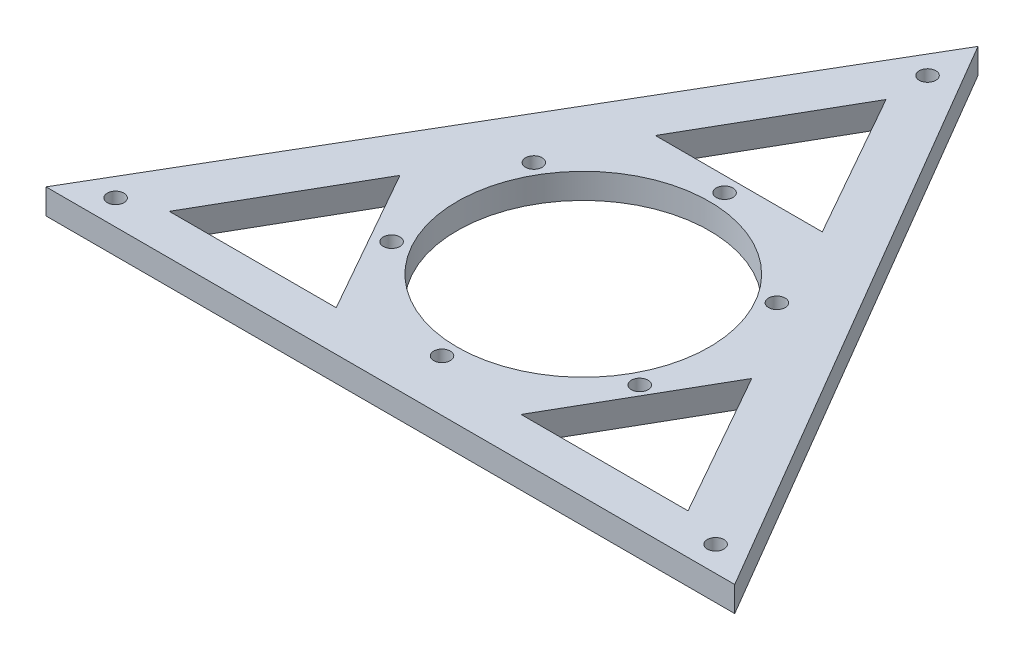
ISO-10303-21;
HEADER;
FILE_DESCRIPTION(('STEP AP214'),'2;1');
FILE_NAME('part.step','',(''),(''),'','','');
FILE_SCHEMA(('AUTOMOTIVE_DESIGN { 1 0 10303 214 1 1 1 1 }'));
ENDSEC;
DATA;
#1=APPLICATION_CONTEXT('core data for automotive mechanical design processes');
#2=APPLICATION_PROTOCOL_DEFINITION('international standard','automotive_design',2000,#1);
#3=PRODUCT_CONTEXT('',#1,'mechanical');
#4=PRODUCT('Part','Part','',(#3));
#5=PRODUCT_RELATED_PRODUCT_CATEGORY('part','',(#4));
#6=PRODUCT_DEFINITION_FORMATION('','',#4);
#7=PRODUCT_DEFINITION_CONTEXT('part definition',#1,'design');
#8=PRODUCT_DEFINITION('design','',#6,#7);
#9=PRODUCT_DEFINITION_SHAPE('','',#8);
#10=(LENGTH_UNIT() NAMED_UNIT(*) SI_UNIT(.MILLI.,.METRE.));
#11=(NAMED_UNIT(*) PLANE_ANGLE_UNIT() SI_UNIT($,.RADIAN.));
#12=(NAMED_UNIT(*) SI_UNIT($,.STERADIAN.) SOLID_ANGLE_UNIT());
#13=UNCERTAINTY_MEASURE_WITH_UNIT(LENGTH_MEASURE(1.E-05),#10,'distance_accuracy_value','');
#14=(GEOMETRIC_REPRESENTATION_CONTEXT(3) GLOBAL_UNCERTAINTY_ASSIGNED_CONTEXT((#13)) GLOBAL_UNIT_ASSIGNED_CONTEXT((#10,
#11,#12)) REPRESENTATION_CONTEXT('',''));
#15=CARTESIAN_POINT('',(0.,0.,0.));
#16=DIRECTION('',(0.,0.,1.));
#17=DIRECTION('',(1.,0.,0.));
#18=AXIS2_PLACEMENT_3D('',#15,#16,#17);
#19=CARTESIAN_POINT('',(34.1242695856853,5.,-19.9966620230598));
#20=DIRECTION('',(-0.862777602849667,0.,0.505583631084891));
#21=DIRECTION('',(0.505583631084891,0.,0.862777602849667));
#22=AXIS2_PLACEMENT_3D('',#19,#20,#21);
#23=PLANE('',#22);
#24=DIRECTION('',(-0.505583631084891,0.,-0.862777602849667));
#25=VECTOR('',#24,1.);
#26=CARTESIAN_POINT('',(34.1242695856853,0.,-19.9966620230598));
#27=LINE('',#26,#25);
#28=CARTESIAN_POINT('',(68.2485391713706,0.,38.2363457366197));
#29=VERTEX_POINT('',#28);
#30=CARTESIAN_POINT('',(0.,0.,-78.2296697827392));
#31=VERTEX_POINT('',#30);
#32=EDGE_CURVE('E151',#29,#31,#27,.T.);
#33=ORIENTED_EDGE('',*,*,#32,.T.);
#34=DIRECTION('',(0.,-1.,0.));
#35=VECTOR('',#34,1.);
#36=CARTESIAN_POINT('',(0.,5.,-78.2296697827392));
#37=LINE('',#36,#35);
#38=CARTESIAN_POINT('',(0.,5.,-78.2296697827392));
#39=VERTEX_POINT('',#38);
#40=EDGE_CURVE('E11',#39,#31,#37,.T.);
#41=ORIENTED_EDGE('',*,*,#40,.F.);
#42=DIRECTION('',(-0.505583631084891,0.,-0.862777602849667));
#43=VECTOR('',#42,1.);
#44=CARTESIAN_POINT('',(34.1242695856853,5.,-19.9966620230598));
#45=LINE('',#44,#43);
#46=CARTESIAN_POINT('',(68.2485391713706,5.,38.2363457366197));
#47=VERTEX_POINT('',#46);
#48=EDGE_CURVE('E142',#47,#39,#45,.T.);
#49=ORIENTED_EDGE('',*,*,#48,.F.);
#50=DIRECTION('',(0.,-1.,0.));
#51=VECTOR('',#50,1.);
#52=CARTESIAN_POINT('',(68.2485391713706,5.,38.2363457366197));
#53=LINE('',#52,#51);
#54=EDGE_CURVE('E152',#47,#29,#53,.T.);
#55=ORIENTED_EDGE('',*,*,#54,.T.);
#56=EDGE_LOOP('',(#33,#41,#49,#55));
#57=FACE_BOUND('',#56,.T.);
#58=ADVANCED_FACE('F40',(#57),#23,.F.);
#59=CARTESIAN_POINT('',(-34.1242695856853,5.,-19.9966620230598));
#60=DIRECTION('',(0.862777602849667,0.,0.50558363108489));
#61=DIRECTION('',(0.50558363108489,0.,-0.862777602849667));
#62=AXIS2_PLACEMENT_3D('',#59,#60,#61);
#63=PLANE('',#62);
#64=DIRECTION('',(-0.50558363108489,0.,0.862777602849667));
#65=VECTOR('',#64,1.);
#66=CARTESIAN_POINT('',(-34.1242695856853,0.,-19.9966620230598));
#67=LINE('',#66,#65);
#68=CARTESIAN_POINT('',(-68.2485391713706,0.,38.2363457366197));
#69=VERTEX_POINT('',#68);
#70=EDGE_CURVE('E98',#31,#69,#67,.T.);
#71=ORIENTED_EDGE('',*,*,#70,.T.);
#72=DIRECTION('',(0.,-1.,0.));
#73=VECTOR('',#72,1.);
#74=CARTESIAN_POINT('',(-68.2485391713706,5.,38.2363457366197));
#75=LINE('',#74,#73);
#76=CARTESIAN_POINT('',(-68.2485391713706,5.,38.2363457366197));
#77=VERTEX_POINT('',#76);
#78=EDGE_CURVE('E50',#77,#69,#75,.T.);
#79=ORIENTED_EDGE('',*,*,#78,.F.);
#80=DIRECTION('',(-0.50558363108489,0.,0.862777602849667));
#81=VECTOR('',#80,1.);
#82=CARTESIAN_POINT('',(-34.1242695856853,5.,-19.9966620230598));
#83=LINE('',#82,#81);
#84=EDGE_CURVE('E138',#39,#77,#83,.T.);
#85=ORIENTED_EDGE('',*,*,#84,.F.);
#86=ORIENTED_EDGE('',*,*,#40,.T.);
#87=EDGE_LOOP('',(#71,#79,#85,#86));
#88=FACE_BOUND('',#87,.T.);
#89=ADVANCED_FACE('F139',(#88),#63,.F.);
#90=CARTESIAN_POINT('',(26.5054026808715,5.,15.227281773264));
#91=DIRECTION('',(0.86709460776474,0.,0.498143494572911));
#92=DIRECTION('',(0.498143494572911,0.,-0.86709460776474));
#93=AXIS2_PLACEMENT_3D('',#90,#91,#92);
#94=PLANE('',#93);
#95=DIRECTION('',(-0.498143494572911,0.,0.86709460776474));
#96=VECTOR('',#95,1.);
#97=CARTESIAN_POINT('',(26.5054026808715,0.,15.227281773264));
#98=LINE('',#97,#96);
#99=CARTESIAN_POINT('',(34.5728632341799,0.,1.18463819698696));
#100=VERTEX_POINT('',#99);
#101=CARTESIAN_POINT('',(17.8894885482455,0.,30.2245923208387));
#102=VERTEX_POINT('',#101);
#103=EDGE_CURVE('E162',#100,#102,#98,.T.);
#104=ORIENTED_EDGE('',*,*,#103,.F.);
#105=DIRECTION('',(0.,-1.,0.));
#106=VECTOR('',#105,1.);
#107=CARTESIAN_POINT('',(34.5728632341799,5.,1.18463819698696));
#108=LINE('',#107,#106);
#109=CARTESIAN_POINT('',(34.5728632341799,5.,1.18463819698696));
#110=VERTEX_POINT('',#109);
#111=EDGE_CURVE('E171',#110,#100,#108,.T.);
#112=ORIENTED_EDGE('',*,*,#111,.F.);
#113=DIRECTION('',(-0.498143494572911,0.,0.86709460776474));
#114=VECTOR('',#113,1.);
#115=CARTESIAN_POINT('',(26.5054026808715,5.,15.227281773264));
#116=LINE('',#115,#114);
#117=CARTESIAN_POINT('',(17.8894885482455,5.,30.2245923208387));
#118=VERTEX_POINT('',#117);
#119=EDGE_CURVE('E248',#110,#118,#116,.T.);
#120=ORIENTED_EDGE('',*,*,#119,.T.);
#121=DIRECTION('',(0.,-1.,0.));
#122=VECTOR('',#121,1.);
#123=CARTESIAN_POINT('',(17.8894885482455,5.,30.2245923208387));
#124=LINE('',#123,#122);
#125=EDGE_CURVE('E173',#118,#102,#124,.T.);
#126=ORIENTED_EDGE('',*,*,#125,.T.);
#127=EDGE_LOOP('',(#104,#112,#120,#126));
#128=FACE_BOUND('',#127,.T.);
#129=ADVANCED_FACE('F287',(#128),#94,.T.);
#130=CARTESIAN_POINT('',(25.698264196824,5.,-14.5210072268822));
#131=DIRECTION('',(0.870622313569608,0.,-0.491952017085714));
#132=DIRECTION('',(-0.491952017085714,0.,-0.870622313569608));
#133=AXIS2_PLACEMENT_3D('',#130,#131,#132);
#134=PLANE('',#133);
#135=DIRECTION('',(0.491952017085714,0.,0.870622313569608));
#136=VECTOR('',#135,1.);
#137=CARTESIAN_POINT('',(25.698264196824,0.,-14.5210072268822));
#138=LINE('',#137,#136);
#139=CARTESIAN_POINT('',(50.9821187570838,0.,30.2245923208387));
#140=VERTEX_POINT('',#139);
#141=EDGE_CURVE('E158',#100,#140,#138,.T.);
#142=ORIENTED_EDGE('',*,*,#141,.T.);
#143=DIRECTION('',(0.,-1.,0.));
#144=VECTOR('',#143,1.);
#145=CARTESIAN_POINT('',(50.9821187570838,5.,30.2245923208387));
#146=LINE('',#145,#144);
#147=CARTESIAN_POINT('',(50.9821187570838,5.,30.2245923208387));
#148=VERTEX_POINT('',#147);
#149=EDGE_CURVE('E175',#148,#140,#146,.T.);
#150=ORIENTED_EDGE('',*,*,#149,.F.);
#151=DIRECTION('',(0.491952017085714,0.,0.870622313569608));
#152=VECTOR('',#151,1.);
#153=CARTESIAN_POINT('',(25.698264196824,5.,-14.5210072268822));
#154=LINE('',#153,#152);
#155=EDGE_CURVE('E245',#110,#148,#154,.T.);
#156=ORIENTED_EDGE('',*,*,#155,.F.);
#157=ORIENTED_EDGE('',*,*,#111,.T.);
#158=EDGE_LOOP('',(#142,#150,#156,#157));
#159=FACE_BOUND('',#158,.T.);
#160=ADVANCED_FACE('F277',(#159),#134,.F.);
#161=CARTESIAN_POINT('',(-25.9162522822353,5.,-14.8888164711187));
#162=DIRECTION('',(0.86709460776474,0.,0.498143494572911));
#163=DIRECTION('',(0.498143494572911,0.,-0.86709460776474));
#164=AXIS2_PLACEMENT_3D('',#161,#162,#163);
#165=PLANE('',#164);
#166=DIRECTION('',(-0.498143494572911,0.,0.86709460776474));
#167=VECTOR('',#166,1.);
#168=CARTESIAN_POINT('',(-25.9162522822353,0.,-14.8888164711187));
#169=LINE('',#168,#167);
#170=CARTESIAN_POINT('',(0.,0.,-60.));
#171=VERTEX_POINT('',#170);
#172=CARTESIAN_POINT('',(-16.6833746859344,0.,-30.9600458761483));
#173=VERTEX_POINT('',#172);
#174=EDGE_CURVE('E257',#171,#173,#169,.T.);
#175=ORIENTED_EDGE('',*,*,#174,.F.);
#176=DIRECTION('',(0.,-1.,0.));
#177=VECTOR('',#176,1.);
#178=CARTESIAN_POINT('',(0.,5.,-60.));
#179=LINE('',#178,#177);
#180=CARTESIAN_POINT('',(0.,5.,-60.));
#181=VERTEX_POINT('',#180);
#182=EDGE_CURVE('E176',#181,#171,#179,.T.);
#183=ORIENTED_EDGE('',*,*,#182,.F.);
#184=DIRECTION('',(-0.498143494572911,0.,0.86709460776474));
#185=VECTOR('',#184,1.);
#186=CARTESIAN_POINT('',(-25.9162522822353,5.,-14.8888164711187));
#187=LINE('',#186,#185);
#188=CARTESIAN_POINT('',(-16.6833746859344,5.,-30.9600458761483));
#189=VERTEX_POINT('',#188);
#190=EDGE_CURVE('E237',#181,#189,#187,.T.);
#191=ORIENTED_EDGE('',*,*,#190,.T.);
#192=DIRECTION('',(0.,-1.,0.));
#193=VECTOR('',#192,1.);
#194=CARTESIAN_POINT('',(-16.6833746859344,5.,-30.9600458761483));
#195=LINE('',#194,#193);
#196=EDGE_CURVE('E179',#189,#173,#195,.T.);
#197=ORIENTED_EDGE('',*,*,#196,.T.);
#198=EDGE_LOOP('',(#175,#183,#191,#197));
#199=FACE_BOUND('',#198,.T.);
#200=ADVANCED_FACE('F294',(#199),#165,.T.);
#201=CARTESIAN_POINT('',(16.4092555229039,0.,-30.9600458761482));
#202=VERTEX_POINT('',#201);
#203=EDGE_CURVE('E261',#171,#202,#138,.T.);
#204=ORIENTED_EDGE('',*,*,#203,.T.);
#205=DIRECTION('',(0.,-1.,0.));
#206=VECTOR('',#205,1.);
#207=CARTESIAN_POINT('',(16.4092555229039,5.,-30.9600458761482));
#208=LINE('',#207,#206);
#209=CARTESIAN_POINT('',(16.4092555229039,5.,-30.9600458761482));
#210=VERTEX_POINT('',#209);
#211=EDGE_CURVE('E181',#210,#202,#208,.T.);
#212=ORIENTED_EDGE('',*,*,#211,.F.);
#213=EDGE_CURVE('E242',#181,#210,#154,.T.);
#214=ORIENTED_EDGE('',*,*,#213,.F.);
#215=ORIENTED_EDGE('',*,*,#182,.T.);
#216=EDGE_LOOP('',(#204,#212,#214,#215));
#217=FACE_BOUND('',#216,.T.);
#218=ADVANCED_FACE('F296',(#217),#134,.F.);
#219=CARTESIAN_POINT('',(-35.150408286123,0.,1.18463819698696));
#220=VERTEX_POINT('',#219);
#221=CARTESIAN_POINT('',(-51.8337829720574,0.,30.2245923208387));
#222=VERTEX_POINT('',#221);
#223=EDGE_CURVE('E234',#220,#222,#169,.T.);
#224=ORIENTED_EDGE('',*,*,#223,.F.);
#225=DIRECTION('',(0.,-1.,0.));
#226=VECTOR('',#225,1.);
#227=CARTESIAN_POINT('',(-35.150408286123,5.,1.18463819698696));
#228=LINE('',#227,#226);
#229=CARTESIAN_POINT('',(-35.150408286123,5.,1.18463819698696));
#230=VERTEX_POINT('',#229);
#231=EDGE_CURVE('E112',#230,#220,#228,.T.);
#232=ORIENTED_EDGE('',*,*,#231,.F.);
#233=CARTESIAN_POINT('',(-51.8337829720574,5.,30.2245923208387));
#234=VERTEX_POINT('',#233);
#235=EDGE_CURVE('E169',#230,#234,#187,.T.);
#236=ORIENTED_EDGE('',*,*,#235,.T.);
#237=DIRECTION('',(0.,-1.,0.));
#238=VECTOR('',#237,1.);
#239=CARTESIAN_POINT('',(-51.8337829720574,5.,30.2245923208387));
#240=LINE('',#239,#238);
#241=EDGE_CURVE('E184',#234,#222,#240,.T.);
#242=ORIENTED_EDGE('',*,*,#241,.T.);
#243=EDGE_LOOP('',(#224,#232,#236,#242));
#244=FACE_BOUND('',#243,.T.);
#245=ADVANCED_FACE('F326',(#244),#165,.T.);
#246=CARTESIAN_POINT('',(-27.1508051630091,5.,15.3417769763785));
#247=DIRECTION('',(0.870622313569608,0.,-0.491952017085714));
#248=DIRECTION('',(-0.491952017085714,0.,-0.870622313569608));
#249=AXIS2_PLACEMENT_3D('',#246,#247,#248);
#250=PLANE('',#249);
#251=DIRECTION('',(0.491952017085714,0.,0.870622313569608));
#252=VECTOR('',#251,1.);
#253=CARTESIAN_POINT('',(-27.1508051630091,0.,15.3417769763785));
#254=LINE('',#253,#252);
#255=CARTESIAN_POINT('',(-18.7411527632191,0.,30.2245923208387));
#256=VERTEX_POINT('',#255);
#257=EDGE_CURVE('E256',#220,#256,#254,.T.);
#258=ORIENTED_EDGE('',*,*,#257,.T.);
#259=DIRECTION('',(0.,-1.,0.));
#260=VECTOR('',#259,1.);
#261=CARTESIAN_POINT('',(-18.7411527632191,5.,30.2245923208387));
#262=LINE('',#261,#260);
#263=CARTESIAN_POINT('',(-18.7411527632191,5.,30.2245923208387));
#264=VERTEX_POINT('',#263);
#265=EDGE_CURVE('E186',#264,#256,#262,.T.);
#266=ORIENTED_EDGE('',*,*,#265,.F.);
#267=DIRECTION('',(0.491952017085714,0.,0.870622313569608));
#268=VECTOR('',#267,1.);
#269=CARTESIAN_POINT('',(-27.1508051630091,5.,15.3417769763785));
#270=LINE('',#269,#268);
#271=EDGE_CURVE('E236',#230,#264,#270,.T.);
#272=ORIENTED_EDGE('',*,*,#271,.F.);
#273=ORIENTED_EDGE('',*,*,#231,.T.);
#274=EDGE_LOOP('',(#258,#266,#272,#273));
#275=FACE_BOUND('',#274,.T.);
#276=ADVANCED_FACE('F42',(#275),#250,.F.);
#277=CARTESIAN_POINT('',(0.,5.,38.2363457366197));
#278=DIRECTION('',(0.,0.,-1.));
#279=DIRECTION('',(-1.,0.,0.));
#280=AXIS2_PLACEMENT_3D('',#277,#278,#279);
#281=PLANE('',#280);
#282=DIRECTION('',(1.,0.,0.));
#283=VECTOR('',#282,1.);
#284=CARTESIAN_POINT('',(0.,0.,38.2363457366197));
#285=LINE('',#284,#283);
#286=EDGE_CURVE('E104',#69,#29,#285,.T.);
#287=ORIENTED_EDGE('',*,*,#286,.T.);
#288=ORIENTED_EDGE('',*,*,#54,.F.);
#289=DIRECTION('',(1.,0.,0.));
#290=VECTOR('',#289,1.);
#291=CARTESIAN_POINT('',(0.,5.,38.2363457366197));
#292=LINE('',#291,#290);
#293=EDGE_CURVE('E59',#77,#47,#292,.T.);
#294=ORIENTED_EDGE('',*,*,#293,.F.);
#295=ORIENTED_EDGE('',*,*,#78,.T.);
#296=EDGE_LOOP('',(#287,#288,#294,#295));
#297=FACE_BOUND('',#296,.T.);
#298=ADVANCED_FACE('F307',(#297),#281,.F.);
#299=CARTESIAN_POINT('',(0.,5.,30.2245923208387));
#300=DIRECTION('',(0.,0.,-1.));
#301=DIRECTION('',(-1.,0.,0.));
#302=AXIS2_PLACEMENT_3D('',#299,#300,#301);
#303=PLANE('',#302);
#304=DIRECTION('',(1.,0.,0.));
#305=VECTOR('',#304,1.);
#306=CARTESIAN_POINT('',(0.,0.,30.2245923208387));
#307=LINE('',#306,#305);
#308=EDGE_CURVE('E154',#102,#140,#307,.T.);
#309=ORIENTED_EDGE('',*,*,#308,.F.);
#310=ORIENTED_EDGE('',*,*,#125,.F.);
#311=DIRECTION('',(1.,0.,0.));
#312=VECTOR('',#311,1.);
#313=CARTESIAN_POINT('',(0.,5.,30.2245923208387));
#314=LINE('',#313,#312);
#315=EDGE_CURVE('E148',#118,#148,#314,.T.);
#316=ORIENTED_EDGE('',*,*,#315,.T.);
#317=ORIENTED_EDGE('',*,*,#149,.T.);
#318=EDGE_LOOP('',(#309,#310,#316,#317));
#319=FACE_BOUND('',#318,.T.);
#320=ADVANCED_FACE('F282',(#319),#303,.T.);
#321=CARTESIAN_POINT('',(0.,5.,-30.9600458761482));
#322=DIRECTION('',(0.,0.,-1.));
#323=DIRECTION('',(-1.,0.,0.));
#324=AXIS2_PLACEMENT_3D('',#321,#322,#323);
#325=PLANE('',#324);
#326=DIRECTION('',(1.,0.,0.));
#327=VECTOR('',#326,1.);
#328=CARTESIAN_POINT('',(0.,0.,-30.9600458761482));
#329=LINE('',#328,#327);
#330=EDGE_CURVE('E263',#173,#202,#329,.T.);
#331=ORIENTED_EDGE('',*,*,#330,.F.);
#332=ORIENTED_EDGE('',*,*,#196,.F.);
#333=DIRECTION('',(1.,0.,0.));
#334=VECTOR('',#333,1.);
#335=CARTESIAN_POINT('',(0.,5.,-30.9600458761482));
#336=LINE('',#335,#334);
#337=EDGE_CURVE('E244',#189,#210,#336,.T.);
#338=ORIENTED_EDGE('',*,*,#337,.T.);
#339=ORIENTED_EDGE('',*,*,#211,.T.);
#340=EDGE_LOOP('',(#331,#332,#338,#339));
#341=FACE_BOUND('',#340,.T.);
#342=ADVANCED_FACE('F306',(#341),#325,.T.);
#343=EDGE_CURVE('E160',#222,#256,#307,.T.);
#344=ORIENTED_EDGE('',*,*,#343,.F.);
#345=ORIENTED_EDGE('',*,*,#241,.F.);
#346=EDGE_CURVE('E239',#234,#264,#314,.T.);
#347=ORIENTED_EDGE('',*,*,#346,.T.);
#348=ORIENTED_EDGE('',*,*,#265,.T.);
#349=EDGE_LOOP('',(#344,#345,#347,#348));
#350=FACE_BOUND('',#349,.T.);
#351=ADVANCED_FACE('F308',(#350),#303,.T.);
#352=CARTESIAN_POINT('',(0.,5.,0.));
#353=DIRECTION('',(0.,-1.,0.));
#354=DIRECTION('',(0.,0.,-1.));
#355=AXIS2_PLACEMENT_3D('',#352,#353,#354);
#356=CYLINDRICAL_SURFACE('',#355,25.);
#357=CARTESIAN_POINT('',(0.,5.,0.));
#358=DIRECTION('',(0.,1.,0.));
#359=DIRECTION('',(0.,0.,1.));
#360=AXIS2_PLACEMENT_3D('',#357,#358,#359);
#361=CIRCLE('',#360,25.);
#362=CARTESIAN_POINT('',(0.,5.,25.));
#363=VERTEX_POINT('',#362);
#364=EDGE_CURVE('E187',#363,#363,#361,.T.);
#365=ORIENTED_EDGE('',*,*,#364,.T.);
#366=EDGE_LOOP('',(#365));
#367=FACE_BOUND('',#366,.T.);
#368=CARTESIAN_POINT('',(0.,0.,0.));
#369=DIRECTION('',(0.,1.,0.));
#370=DIRECTION('',(0.,0.,1.));
#371=AXIS2_PLACEMENT_3D('',#368,#369,#370);
#372=CIRCLE('',#371,25.);
#373=CARTESIAN_POINT('',(0.,0.,25.));
#374=VERTEX_POINT('',#373);
#375=EDGE_CURVE('E166',#374,#374,#372,.T.);
#376=ORIENTED_EDGE('',*,*,#375,.F.);
#377=EDGE_LOOP('',(#376));
#378=FACE_BOUND('',#377,.T.);
#379=ADVANCED_FACE('F315',(#367,#378),#356,.F.);
#380=CARTESIAN_POINT('',(0.,5.,0.));
#381=DIRECTION('',(0.,1.,0.));
#382=DIRECTION('',(0.,0.,1.));
#383=AXIS2_PLACEMENT_3D('',#380,#381,#382);
#384=PLANE('',#383);
#385=CARTESIAN_POINT('',(0.,5.,-68.2296697827392));
#386=DIRECTION('',(0.,1.,0.));
#387=DIRECTION('',(0.,0.,1.));
#388=AXIS2_PLACEMENT_3D('',#385,#386,#387);
#389=CIRCLE('',#388,1.64999999999999);
#390=CARTESIAN_POINT('',(0.,5.,-66.5796697827393));
#391=VERTEX_POINT('',#390);
#392=EDGE_CURVE('E399',#391,#391,#389,.T.);
#393=ORIENTED_EDGE('',*,*,#392,.F.);
#394=EDGE_LOOP('',(#393));
#395=FACE_BOUND('',#394,.T.);
#396=CARTESIAN_POINT('',(-59.4586094823929,5.,33.2363457366198));
#397=DIRECTION('',(0.,1.,0.));
#398=DIRECTION('',(0.,0.,1.));
#399=AXIS2_PLACEMENT_3D('',#396,#397,#398);
#400=CIRCLE('',#399,1.64999999999999);
#401=CARTESIAN_POINT('',(-59.4586094823929,5.,34.8863457366197));
#402=VERTEX_POINT('',#401);
#403=EDGE_CURVE('E402',#402,#402,#400,.T.);
#404=ORIENTED_EDGE('',*,*,#403,.F.);
#405=EDGE_LOOP('',(#404));
#406=FACE_BOUND('',#405,.T.);
#407=CARTESIAN_POINT('',(59.4586094823929,5.,33.2363457366198));
#408=DIRECTION('',(0.,1.,0.));
#409=DIRECTION('',(0.,0.,1.));
#410=AXIS2_PLACEMENT_3D('',#407,#408,#409);
#411=CIRCLE('',#410,1.64999999999999);
#412=CARTESIAN_POINT('',(59.4586094823929,5.,34.8863457366197));
#413=VERTEX_POINT('',#412);
#414=EDGE_CURVE('E217',#413,#413,#411,.T.);
#415=ORIENTED_EDGE('',*,*,#414,.F.);
#416=EDGE_LOOP('',(#415));
#417=FACE_BOUND('',#416,.T.);
#418=CARTESIAN_POINT('',(-24.0822535669175,5.,-14.2844342953681));
#419=DIRECTION('',(0.,1.,0.));
#420=DIRECTION('',(0.,0.,1.));
#421=AXIS2_PLACEMENT_3D('',#418,#419,#420);
#422=CIRCLE('',#421,1.64999999999999);
#423=CARTESIAN_POINT('',(-24.0822535669175,5.,-12.6344342953681));
#424=VERTEX_POINT('',#423);
#425=EDGE_CURVE('E205',#424,#424,#422,.T.);
#426=ORIENTED_EDGE('',*,*,#425,.F.);
#427=EDGE_LOOP('',(#426));
#428=FACE_BOUND('',#427,.T.);
#429=CARTESIAN_POINT('',(0.,5.,-28.));
#430=DIRECTION('',(0.,1.,0.));
#431=DIRECTION('',(0.,0.,1.));
#432=AXIS2_PLACEMENT_3D('',#429,#430,#431);
#433=CIRCLE('',#432,1.64999999999999);
#434=CARTESIAN_POINT('',(0.,5.,-26.35));
#435=VERTEX_POINT('',#434);
#436=EDGE_CURVE('E204',#435,#435,#433,.T.);
#437=ORIENTED_EDGE('',*,*,#436,.F.);
#438=EDGE_LOOP('',(#437));
#439=FACE_BOUND('',#438,.T.);
#440=CARTESIAN_POINT('',(24.0822535669175,5.,-14.2844342953681));
#441=DIRECTION('',(0.,1.,0.));
#442=DIRECTION('',(0.,0.,1.));
#443=AXIS2_PLACEMENT_3D('',#440,#441,#442);
#444=CIRCLE('',#443,1.64999999999999);
#445=CARTESIAN_POINT('',(24.0822535669175,5.,-12.6344342953681));
#446=VERTEX_POINT('',#445);
#447=EDGE_CURVE('E201',#446,#446,#444,.T.);
#448=ORIENTED_EDGE('',*,*,#447,.F.);
#449=EDGE_LOOP('',(#448));
#450=FACE_BOUND('',#449,.T.);
#451=CARTESIAN_POINT('',(24.5856528528678,5.,13.3994654295711));
#452=DIRECTION('',(0.,1.,0.));
#453=DIRECTION('',(0.,0.,1.));
#454=AXIS2_PLACEMENT_3D('',#451,#452,#453);
#455=CIRCLE('',#454,1.64999999999999);
#456=CARTESIAN_POINT('',(24.5856528528678,5.,15.0494654295711));
#457=VERTEX_POINT('',#456);
#458=EDGE_CURVE('E198',#457,#457,#455,.T.);
#459=ORIENTED_EDGE('',*,*,#458,.F.);
#460=EDGE_LOOP('',(#459));
#461=FACE_BOUND('',#460,.T.);
#462=CARTESIAN_POINT('',(0.,5.,28.));
#463=DIRECTION('',(0.,1.,0.));
#464=DIRECTION('',(0.,0.,1.));
#465=AXIS2_PLACEMENT_3D('',#462,#463,#464);
#466=CIRCLE('',#465,1.64999999999999);
#467=CARTESIAN_POINT('',(0.,5.,29.65));
#468=VERTEX_POINT('',#467);
#469=EDGE_CURVE('E194',#468,#468,#466,.T.);
#470=ORIENTED_EDGE('',*,*,#469,.F.);
#471=EDGE_LOOP('',(#470));
#472=FACE_BOUND('',#471,.T.);
#473=CARTESIAN_POINT('',(-24.5856528528678,5.,13.3994654295711));
#474=DIRECTION('',(0.,1.,0.));
#475=DIRECTION('',(0.,0.,1.));
#476=AXIS2_PLACEMENT_3D('',#473,#474,#475);
#477=CIRCLE('',#476,1.64999999999999);
#478=CARTESIAN_POINT('',(-24.5856528528678,5.,15.0494654295711));
#479=VERTEX_POINT('',#478);
#480=EDGE_CURVE('E193',#479,#479,#477,.T.);
#481=ORIENTED_EDGE('',*,*,#480,.F.);
#482=EDGE_LOOP('',(#481));
#483=FACE_BOUND('',#482,.T.);
#484=ORIENTED_EDGE('',*,*,#235,.F.);
#485=ORIENTED_EDGE('',*,*,#271,.T.);
#486=ORIENTED_EDGE('',*,*,#346,.F.);
#487=EDGE_LOOP('',(#484,#485,#486));
#488=FACE_BOUND('',#487,.T.);
#489=ORIENTED_EDGE('',*,*,#190,.F.);
#490=ORIENTED_EDGE('',*,*,#213,.T.);
#491=ORIENTED_EDGE('',*,*,#337,.F.);
#492=EDGE_LOOP('',(#489,#490,#491));
#493=FACE_BOUND('',#492,.T.);
#494=ORIENTED_EDGE('',*,*,#119,.F.);
#495=ORIENTED_EDGE('',*,*,#155,.T.);
#496=ORIENTED_EDGE('',*,*,#315,.F.);
#497=EDGE_LOOP('',(#494,#495,#496));
#498=FACE_BOUND('',#497,.T.);
#499=ORIENTED_EDGE('',*,*,#48,.T.);
#500=ORIENTED_EDGE('',*,*,#84,.T.);
#501=ORIENTED_EDGE('',*,*,#293,.T.);
#502=EDGE_LOOP('',(#499,#500,#501));
#503=FACE_BOUND('',#502,.T.);
#504=ORIENTED_EDGE('',*,*,#364,.F.);
#505=EDGE_LOOP('',(#504));
#506=FACE_BOUND('',#505,.T.);
#507=ADVANCED_FACE('F145',(#395,#406,#417,#428,#439,#450,#461,#472,#483,#488,#493,#498,#503,
#506),#384,.T.);
#508=CARTESIAN_POINT('',(0.,0.,0.));
#509=DIRECTION('',(0.,1.,0.));
#510=DIRECTION('',(0.,0.,1.));
#511=AXIS2_PLACEMENT_3D('',#508,#509,#510);
#512=PLANE('',#511);
#513=CARTESIAN_POINT('',(0.,0.,-68.2296697827392));
#514=DIRECTION('',(0.,1.,0.));
#515=DIRECTION('',(0.,0.,1.));
#516=AXIS2_PLACEMENT_3D('',#513,#514,#515);
#517=CIRCLE('',#516,1.64999999999999);
#518=CARTESIAN_POINT('',(0.,0.,-66.5796697827393));
#519=VERTEX_POINT('',#518);
#520=EDGE_CURVE('E44',#519,#519,#517,.T.);
#521=ORIENTED_EDGE('',*,*,#520,.T.);
#522=EDGE_LOOP('',(#521));
#523=FACE_BOUND('',#522,.T.);
#524=CARTESIAN_POINT('',(-59.4586094823929,0.,33.2363457366198));
#525=DIRECTION('',(0.,1.,0.));
#526=DIRECTION('',(0.,0.,1.));
#527=AXIS2_PLACEMENT_3D('',#524,#525,#526);
#528=CIRCLE('',#527,1.64999999999999);
#529=CARTESIAN_POINT('',(-59.4586094823929,0.,34.8863457366197));
#530=VERTEX_POINT('',#529);
#531=EDGE_CURVE('E404',#530,#530,#528,.T.);
#532=ORIENTED_EDGE('',*,*,#531,.T.);
#533=EDGE_LOOP('',(#532));
#534=FACE_BOUND('',#533,.T.);
#535=CARTESIAN_POINT('',(59.4586094823929,0.,33.2363457366198));
#536=DIRECTION('',(0.,1.,0.));
#537=DIRECTION('',(0.,0.,1.));
#538=AXIS2_PLACEMENT_3D('',#535,#536,#537);
#539=CIRCLE('',#538,1.64999999999999);
#540=CARTESIAN_POINT('',(59.4586094823929,0.,34.8863457366197));
#541=VERTEX_POINT('',#540);
#542=EDGE_CURVE('E212',#541,#541,#539,.T.);
#543=ORIENTED_EDGE('',*,*,#542,.T.);
#544=EDGE_LOOP('',(#543));
#545=FACE_BOUND('',#544,.T.);
#546=CARTESIAN_POINT('',(-24.0822535669175,0.,-14.2844342953681));
#547=DIRECTION('',(0.,1.,0.));
#548=DIRECTION('',(0.,0.,1.));
#549=AXIS2_PLACEMENT_3D('',#546,#547,#548);
#550=CIRCLE('',#549,1.64999999999999);
#551=CARTESIAN_POINT('',(-24.0822535669175,0.,-12.6344342953681));
#552=VERTEX_POINT('',#551);
#553=EDGE_CURVE('E202',#552,#552,#550,.T.);
#554=ORIENTED_EDGE('',*,*,#553,.T.);
#555=EDGE_LOOP('',(#554));
#556=FACE_BOUND('',#555,.T.);
#557=CARTESIAN_POINT('',(0.,0.,-28.));
#558=DIRECTION('',(0.,1.,0.));
#559=DIRECTION('',(0.,0.,1.));
#560=AXIS2_PLACEMENT_3D('',#557,#558,#559);
#561=CIRCLE('',#560,1.64999999999999);
#562=CARTESIAN_POINT('',(0.,0.,-26.35));
#563=VERTEX_POINT('',#562);
#564=EDGE_CURVE('E209',#563,#563,#561,.T.);
#565=ORIENTED_EDGE('',*,*,#564,.T.);
#566=EDGE_LOOP('',(#565));
#567=FACE_BOUND('',#566,.T.);
#568=CARTESIAN_POINT('',(24.0822535669175,0.,-14.2844342953681));
#569=DIRECTION('',(0.,1.,0.));
#570=DIRECTION('',(0.,0.,1.));
#571=AXIS2_PLACEMENT_3D('',#568,#569,#570);
#572=CIRCLE('',#571,1.64999999999999);
#573=CARTESIAN_POINT('',(24.0822535669175,0.,-12.6344342953681));
#574=VERTEX_POINT('',#573);
#575=EDGE_CURVE('E199',#574,#574,#572,.T.);
#576=ORIENTED_EDGE('',*,*,#575,.T.);
#577=EDGE_LOOP('',(#576));
#578=FACE_BOUND('',#577,.T.);
#579=CARTESIAN_POINT('',(24.5856528528678,0.,13.3994654295711));
#580=DIRECTION('',(0.,1.,0.));
#581=DIRECTION('',(0.,0.,1.));
#582=AXIS2_PLACEMENT_3D('',#579,#580,#581);
#583=CIRCLE('',#582,1.64999999999999);
#584=CARTESIAN_POINT('',(24.5856528528678,0.,15.0494654295711));
#585=VERTEX_POINT('',#584);
#586=EDGE_CURVE('E195',#585,#585,#583,.T.);
#587=ORIENTED_EDGE('',*,*,#586,.T.);
#588=EDGE_LOOP('',(#587));
#589=FACE_BOUND('',#588,.T.);
#590=CARTESIAN_POINT('',(0.,0.,28.));
#591=DIRECTION('',(0.,1.,0.));
#592=DIRECTION('',(0.,0.,1.));
#593=AXIS2_PLACEMENT_3D('',#590,#591,#592);
#594=CIRCLE('',#593,1.64999999999999);
#595=CARTESIAN_POINT('',(0.,0.,29.65));
#596=VERTEX_POINT('',#595);
#597=EDGE_CURVE('E190',#596,#596,#594,.T.);
#598=ORIENTED_EDGE('',*,*,#597,.T.);
#599=EDGE_LOOP('',(#598));
#600=FACE_BOUND('',#599,.T.);
#601=CARTESIAN_POINT('',(-24.5856528528678,0.,13.3994654295711));
#602=DIRECTION('',(0.,1.,0.));
#603=DIRECTION('',(0.,0.,1.));
#604=AXIS2_PLACEMENT_3D('',#601,#602,#603);
#605=CIRCLE('',#604,1.64999999999999);
#606=CARTESIAN_POINT('',(-24.5856528528678,0.,15.0494654295711));
#607=VERTEX_POINT('',#606);
#608=EDGE_CURVE('E231',#607,#607,#605,.T.);
#609=ORIENTED_EDGE('',*,*,#608,.T.);
#610=EDGE_LOOP('',(#609));
#611=FACE_BOUND('',#610,.T.);
#612=ORIENTED_EDGE('',*,*,#223,.T.);
#613=ORIENTED_EDGE('',*,*,#343,.T.);
#614=ORIENTED_EDGE('',*,*,#257,.F.);
#615=EDGE_LOOP('',(#612,#613,#614));
#616=FACE_BOUND('',#615,.T.);
#617=ORIENTED_EDGE('',*,*,#174,.T.);
#618=ORIENTED_EDGE('',*,*,#330,.T.);
#619=ORIENTED_EDGE('',*,*,#203,.F.);
#620=EDGE_LOOP('',(#617,#618,#619));
#621=FACE_BOUND('',#620,.T.);
#622=ORIENTED_EDGE('',*,*,#103,.T.);
#623=ORIENTED_EDGE('',*,*,#308,.T.);
#624=ORIENTED_EDGE('',*,*,#141,.F.);
#625=EDGE_LOOP('',(#622,#623,#624));
#626=FACE_BOUND('',#625,.T.);
#627=ORIENTED_EDGE('',*,*,#32,.F.);
#628=ORIENTED_EDGE('',*,*,#286,.F.);
#629=ORIENTED_EDGE('',*,*,#70,.F.);
#630=EDGE_LOOP('',(#627,#628,#629));
#631=FACE_BOUND('',#630,.T.);
#632=ORIENTED_EDGE('',*,*,#375,.T.);
#633=EDGE_LOOP('',(#632));
#634=FACE_BOUND('',#633,.T.);
#635=ADVANCED_FACE('F280',(#523,#534,#545,#556,#567,#578,#589,#600,#611,#616,#621,#626,#631,
#634),#512,.F.);
#636=CARTESIAN_POINT('',(-24.5856528528678,5.,13.3994654295711));
#637=DIRECTION('',(0.,1.,0.));
#638=DIRECTION('',(0.,0.,1.));
#639=AXIS2_PLACEMENT_3D('',#636,#637,#638);
#640=CYLINDRICAL_SURFACE('',#639,1.64999999999999);
#641=ORIENTED_EDGE('',*,*,#480,.T.);
#642=EDGE_LOOP('',(#641));
#643=FACE_BOUND('',#642,.T.);
#644=ORIENTED_EDGE('',*,*,#608,.F.);
#645=EDGE_LOOP('',(#644));
#646=FACE_BOUND('',#645,.T.);
#647=ADVANCED_FACE('F356',(#643,#646),#640,.F.);
#648=CARTESIAN_POINT('',(0.,5.,28.));
#649=DIRECTION('',(0.,1.,0.));
#650=DIRECTION('',(0.,0.,1.));
#651=AXIS2_PLACEMENT_3D('',#648,#649,#650);
#652=CYLINDRICAL_SURFACE('',#651,1.64999999999999);
#653=ORIENTED_EDGE('',*,*,#469,.T.);
#654=EDGE_LOOP('',(#653));
#655=FACE_BOUND('',#654,.T.);
#656=ORIENTED_EDGE('',*,*,#597,.F.);
#657=EDGE_LOOP('',(#656));
#658=FACE_BOUND('',#657,.T.);
#659=ADVANCED_FACE('F364',(#655,#658),#652,.F.);
#660=CARTESIAN_POINT('',(24.5856528528678,5.,13.3994654295711));
#661=DIRECTION('',(0.,1.,0.));
#662=DIRECTION('',(0.,0.,1.));
#663=AXIS2_PLACEMENT_3D('',#660,#661,#662);
#664=CYLINDRICAL_SURFACE('',#663,1.64999999999999);
#665=ORIENTED_EDGE('',*,*,#458,.T.);
#666=EDGE_LOOP('',(#665));
#667=FACE_BOUND('',#666,.T.);
#668=ORIENTED_EDGE('',*,*,#586,.F.);
#669=EDGE_LOOP('',(#668));
#670=FACE_BOUND('',#669,.T.);
#671=ADVANCED_FACE('F368',(#667,#670),#664,.F.);
#672=CARTESIAN_POINT('',(24.0822535669175,5.,-14.2844342953681));
#673=DIRECTION('',(0.,1.,0.));
#674=DIRECTION('',(0.,0.,1.));
#675=AXIS2_PLACEMENT_3D('',#672,#673,#674);
#676=CYLINDRICAL_SURFACE('',#675,1.64999999999999);
#677=ORIENTED_EDGE('',*,*,#447,.T.);
#678=EDGE_LOOP('',(#677));
#679=FACE_BOUND('',#678,.T.);
#680=ORIENTED_EDGE('',*,*,#575,.F.);
#681=EDGE_LOOP('',(#680));
#682=FACE_BOUND('',#681,.T.);
#683=ADVANCED_FACE('F372',(#679,#682),#676,.F.);
#684=CARTESIAN_POINT('',(0.,5.,-28.));
#685=DIRECTION('',(0.,1.,0.));
#686=DIRECTION('',(0.,0.,1.));
#687=AXIS2_PLACEMENT_3D('',#684,#685,#686);
#688=CYLINDRICAL_SURFACE('',#687,1.64999999999999);
#689=ORIENTED_EDGE('',*,*,#436,.T.);
#690=EDGE_LOOP('',(#689));
#691=FACE_BOUND('',#690,.T.);
#692=ORIENTED_EDGE('',*,*,#564,.F.);
#693=EDGE_LOOP('',(#692));
#694=FACE_BOUND('',#693,.T.);
#695=ADVANCED_FACE('F376',(#691,#694),#688,.F.);
#696=CARTESIAN_POINT('',(-24.0822535669175,5.,-14.2844342953681));
#697=DIRECTION('',(0.,1.,0.));
#698=DIRECTION('',(0.,0.,1.));
#699=AXIS2_PLACEMENT_3D('',#696,#697,#698);
#700=CYLINDRICAL_SURFACE('',#699,1.64999999999999);
#701=ORIENTED_EDGE('',*,*,#425,.T.);
#702=EDGE_LOOP('',(#701));
#703=FACE_BOUND('',#702,.T.);
#704=ORIENTED_EDGE('',*,*,#553,.F.);
#705=EDGE_LOOP('',(#704));
#706=FACE_BOUND('',#705,.T.);
#707=ADVANCED_FACE('F380',(#703,#706),#700,.F.);
#708=CARTESIAN_POINT('',(59.4586094823929,5.,33.2363457366198));
#709=DIRECTION('',(0.,1.,0.));
#710=DIRECTION('',(0.,0.,1.));
#711=AXIS2_PLACEMENT_3D('',#708,#709,#710);
#712=CYLINDRICAL_SURFACE('',#711,1.64999999999999);
#713=ORIENTED_EDGE('',*,*,#414,.T.);
#714=EDGE_LOOP('',(#713));
#715=FACE_BOUND('',#714,.T.);
#716=ORIENTED_EDGE('',*,*,#542,.F.);
#717=EDGE_LOOP('',(#716));
#718=FACE_BOUND('',#717,.T.);
#719=ADVANCED_FACE('F384',(#715,#718),#712,.F.);
#720=CARTESIAN_POINT('',(-59.4586094823929,5.,33.2363457366198));
#721=DIRECTION('',(0.,1.,0.));
#722=DIRECTION('',(0.,0.,1.));
#723=AXIS2_PLACEMENT_3D('',#720,#721,#722);
#724=CYLINDRICAL_SURFACE('',#723,1.64999999999999);
#725=ORIENTED_EDGE('',*,*,#403,.T.);
#726=EDGE_LOOP('',(#725));
#727=FACE_BOUND('',#726,.T.);
#728=ORIENTED_EDGE('',*,*,#531,.F.);
#729=EDGE_LOOP('',(#728));
#730=FACE_BOUND('',#729,.T.);
#731=ADVANCED_FACE('F387',(#727,#730),#724,.F.);
#732=CARTESIAN_POINT('',(0.,5.,-68.2296697827392));
#733=DIRECTION('',(0.,1.,0.));
#734=DIRECTION('',(0.,0.,1.));
#735=AXIS2_PLACEMENT_3D('',#732,#733,#734);
#736=CYLINDRICAL_SURFACE('',#735,1.64999999999999);
#737=ORIENTED_EDGE('',*,*,#392,.T.);
#738=EDGE_LOOP('',(#737));
#739=FACE_BOUND('',#738,.T.);
#740=ORIENTED_EDGE('',*,*,#520,.F.);
#741=EDGE_LOOP('',(#740));
#742=FACE_BOUND('',#741,.T.);
#743=ADVANCED_FACE('F391',(#739,#742),#736,.F.);
#744=CLOSED_SHELL('',(#58,#89,#129,#160,#200,#218,#245,#276,#298,#320,#342,#351,#379,#507,#635,
#647,#659,#671,#683,#695,#707,#719,#731,#743));
#745=MANIFOLD_SOLID_BREP('B2',#744);
#746=ADVANCED_BREP_SHAPE_REPRESENTATION('',(#18,#745),#14);
#747=SHAPE_DEFINITION_REPRESENTATION(#9,#746);
ENDSEC;
END-ISO-10303-21;
